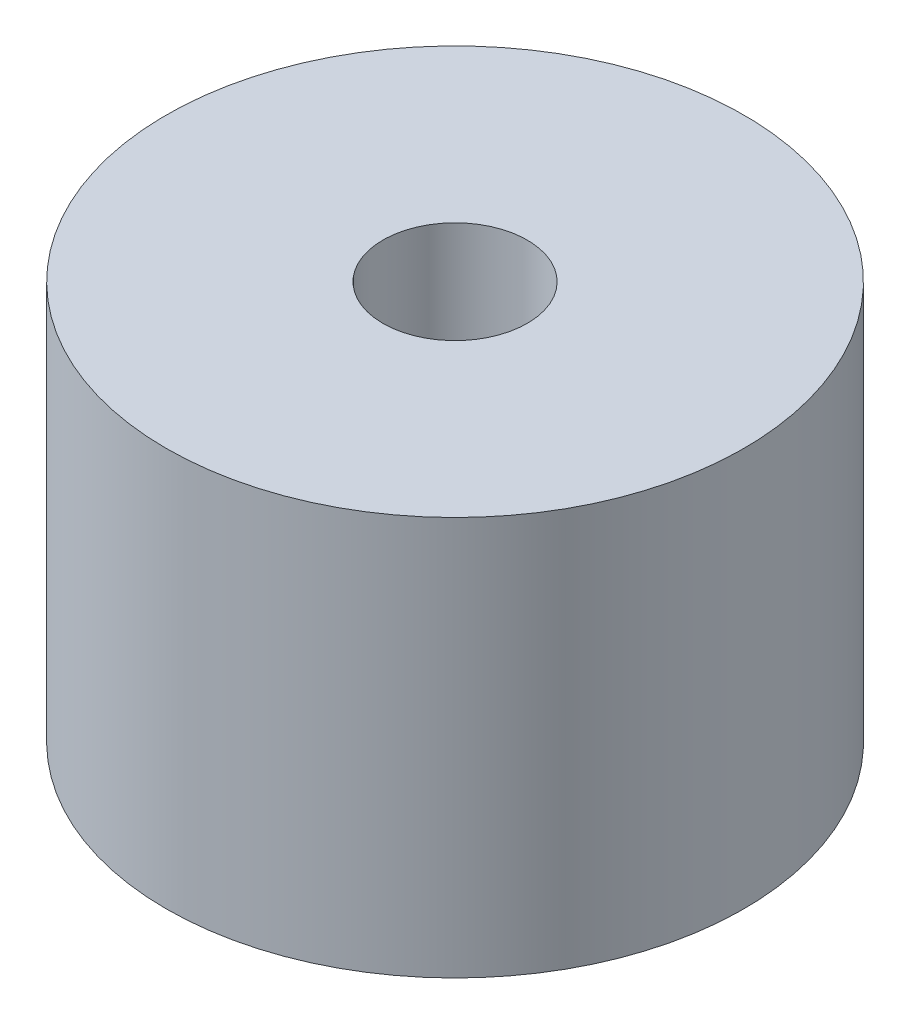
ISO-10303-21;
HEADER;
FILE_DESCRIPTION(('STEP AP214'),'2;1');
FILE_NAME('part.step','',(''),(''),'','','');
FILE_SCHEMA(('AUTOMOTIVE_DESIGN { 1 0 10303 214 1 1 1 1 }'));
ENDSEC;
DATA;
#1=APPLICATION_CONTEXT('core data for automotive mechanical design processes');
#2=APPLICATION_PROTOCOL_DEFINITION('international standard','automotive_design',2000,#1);
#3=PRODUCT_CONTEXT('',#1,'mechanical');
#4=PRODUCT('Part','Part','',(#3));
#5=PRODUCT_RELATED_PRODUCT_CATEGORY('part','',(#4));
#6=PRODUCT_DEFINITION_FORMATION('','',#4);
#7=PRODUCT_DEFINITION_CONTEXT('part definition',#1,'design');
#8=PRODUCT_DEFINITION('design','',#6,#7);
#9=PRODUCT_DEFINITION_SHAPE('','',#8);
#10=(LENGTH_UNIT() NAMED_UNIT(*) SI_UNIT(.MILLI.,.METRE.));
#11=(NAMED_UNIT(*) PLANE_ANGLE_UNIT() SI_UNIT($,.RADIAN.));
#12=(NAMED_UNIT(*) SI_UNIT($,.STERADIAN.) SOLID_ANGLE_UNIT());
#13=UNCERTAINTY_MEASURE_WITH_UNIT(LENGTH_MEASURE(1.E-05),#10,'distance_accuracy_value','');
#14=(GEOMETRIC_REPRESENTATION_CONTEXT(3) GLOBAL_UNCERTAINTY_ASSIGNED_CONTEXT((#13)) GLOBAL_UNIT_ASSIGNED_CONTEXT((#10,
#11,#12)) REPRESENTATION_CONTEXT('',''));
#15=CARTESIAN_POINT('',(0.,0.,0.));
#16=DIRECTION('',(0.,0.,1.));
#17=DIRECTION('',(1.,0.,0.));
#18=AXIS2_PLACEMENT_3D('',#15,#16,#17);
#19=CARTESIAN_POINT('',(0.,2.9,0.));
#20=DIRECTION('',(0.,-1.,0.));
#21=DIRECTION('',(0.,0.,-1.));
#22=AXIS2_PLACEMENT_3D('',#19,#20,#21);
#23=CYLINDRICAL_SURFACE('',#22,4.2);
#24=CARTESIAN_POINT('',(0.,2.9,0.));
#25=DIRECTION('',(0.,1.,0.));
#26=DIRECTION('',(0.,0.,1.));
#27=AXIS2_PLACEMENT_3D('',#24,#25,#26);
#28=CIRCLE('',#27,4.2);
#29=CARTESIAN_POINT('',(0.,2.9,4.2));
#30=VERTEX_POINT('',#29);
#31=EDGE_CURVE('E10',#30,#30,#28,.T.);
#32=ORIENTED_EDGE('',*,*,#31,.F.);
#33=EDGE_LOOP('',(#32));
#34=FACE_BOUND('',#33,.T.);
#35=CARTESIAN_POINT('',(0.,-2.9,0.));
#36=DIRECTION('',(0.,1.,0.));
#37=DIRECTION('',(0.,0.,1.));
#38=AXIS2_PLACEMENT_3D('',#35,#36,#37);
#39=CIRCLE('',#38,4.2);
#40=CARTESIAN_POINT('',(0.,-2.9,4.2));
#41=VERTEX_POINT('',#40);
#42=EDGE_CURVE('E34',#41,#41,#39,.T.);
#43=ORIENTED_EDGE('',*,*,#42,.T.);
#44=EDGE_LOOP('',(#43));
#45=FACE_BOUND('',#44,.T.);
#46=ADVANCED_FACE('F31',(#34,#45),#23,.T.);
#47=CARTESIAN_POINT('',(0.,2.9,0.));
#48=DIRECTION('',(0.,1.,0.));
#49=DIRECTION('',(0.,0.,1.));
#50=AXIS2_PLACEMENT_3D('',#47,#48,#49);
#51=PLANE('',#50);
#52=CARTESIAN_POINT('',(0.,2.9,0.));
#53=DIRECTION('',(0.,1.,0.));
#54=DIRECTION('',(0.,0.,1.));
#55=AXIS2_PLACEMENT_3D('',#52,#53,#54);
#56=CIRCLE('',#55,1.05);
#57=CARTESIAN_POINT('',(0.,2.9,1.05));
#58=VERTEX_POINT('',#57);
#59=EDGE_CURVE('E45',#58,#58,#56,.T.);
#60=ORIENTED_EDGE('',*,*,#59,.F.);
#61=EDGE_LOOP('',(#60));
#62=FACE_BOUND('',#61,.T.);
#63=ORIENTED_EDGE('',*,*,#31,.T.);
#64=EDGE_LOOP('',(#63));
#65=FACE_BOUND('',#64,.T.);
#66=ADVANCED_FACE('F51',(#62,#65),#51,.T.);
#67=CARTESIAN_POINT('',(0.,-2.9,0.));
#68=DIRECTION('',(0.,1.,0.));
#69=DIRECTION('',(0.,0.,1.));
#70=AXIS2_PLACEMENT_3D('',#67,#68,#69);
#71=PLANE('',#70);
#72=CARTESIAN_POINT('',(0.,-2.9,0.));
#73=DIRECTION('',(0.,1.,0.));
#74=DIRECTION('',(0.,0.,1.));
#75=AXIS2_PLACEMENT_3D('',#72,#73,#74);
#76=CIRCLE('',#75,1.05);
#77=CARTESIAN_POINT('',(0.,-2.9,1.05));
#78=VERTEX_POINT('',#77);
#79=EDGE_CURVE('E41',#78,#78,#76,.T.);
#80=ORIENTED_EDGE('',*,*,#79,.T.);
#81=EDGE_LOOP('',(#80));
#82=FACE_BOUND('',#81,.T.);
#83=ORIENTED_EDGE('',*,*,#42,.F.);
#84=EDGE_LOOP('',(#83));
#85=FACE_BOUND('',#84,.T.);
#86=ADVANCED_FACE('F53',(#82,#85),#71,.F.);
#87=CARTESIAN_POINT('',(0.,2.9,0.));
#88=DIRECTION('',(0.,1.,0.));
#89=DIRECTION('',(0.,0.,1.));
#90=AXIS2_PLACEMENT_3D('',#87,#88,#89);
#91=CYLINDRICAL_SURFACE('',#90,1.05);
#92=ORIENTED_EDGE('',*,*,#79,.F.);
#93=EDGE_LOOP('',(#92));
#94=FACE_BOUND('',#93,.T.);
#95=ORIENTED_EDGE('',*,*,#59,.T.);
#96=EDGE_LOOP('',(#95));
#97=FACE_BOUND('',#96,.T.);
#98=ADVANCED_FACE('F49',(#94,#97),#91,.F.);
#99=CLOSED_SHELL('',(#46,#66,#86,#98));
#100=MANIFOLD_SOLID_BREP('B2',#99);
#101=ADVANCED_BREP_SHAPE_REPRESENTATION('',(#18,#100),#14);
#102=SHAPE_DEFINITION_REPRESENTATION(#9,#101);
ENDSEC;
END-ISO-10303-21;
